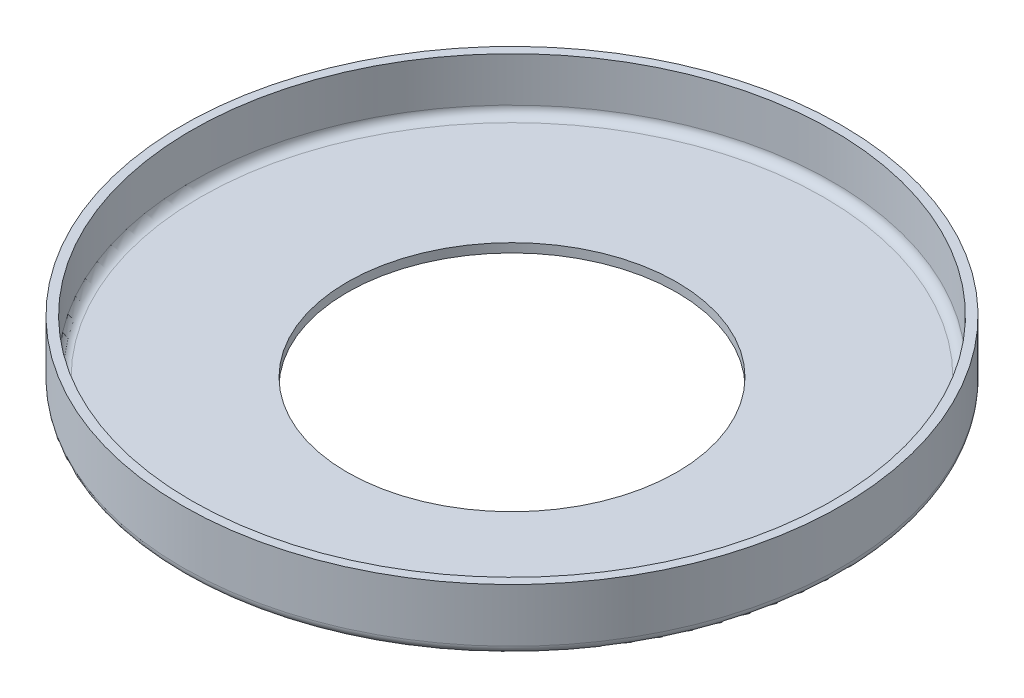
ISO-10303-21;
HEADER;
FILE_DESCRIPTION(('STEP AP214'),'2;1');
FILE_NAME('part.step','',(''),(''),'','','');
FILE_SCHEMA(('AUTOMOTIVE_DESIGN { 1 0 10303 214 1 1 1 1 }'));
ENDSEC;
DATA;
#1=APPLICATION_CONTEXT('core data for automotive mechanical design processes');
#2=APPLICATION_PROTOCOL_DEFINITION('international standard','automotive_design',2000,#1);
#3=PRODUCT_CONTEXT('',#1,'mechanical');
#4=PRODUCT('Part','Part','',(#3));
#5=PRODUCT_RELATED_PRODUCT_CATEGORY('part','',(#4));
#6=PRODUCT_DEFINITION_FORMATION('','',#4);
#7=PRODUCT_DEFINITION_CONTEXT('part definition',#1,'design');
#8=PRODUCT_DEFINITION('design','',#6,#7);
#9=PRODUCT_DEFINITION_SHAPE('','',#8);
#10=(LENGTH_UNIT() NAMED_UNIT(*) SI_UNIT(.MILLI.,.METRE.));
#11=(NAMED_UNIT(*) PLANE_ANGLE_UNIT() SI_UNIT($,.RADIAN.));
#12=(NAMED_UNIT(*) SI_UNIT($,.STERADIAN.) SOLID_ANGLE_UNIT());
#13=UNCERTAINTY_MEASURE_WITH_UNIT(LENGTH_MEASURE(1.E-05),#10,'distance_accuracy_value','');
#14=(GEOMETRIC_REPRESENTATION_CONTEXT(3) GLOBAL_UNCERTAINTY_ASSIGNED_CONTEXT((#13)) GLOBAL_UNIT_ASSIGNED_CONTEXT((#10,
#11,#12)) REPRESENTATION_CONTEXT('',''));
#15=CARTESIAN_POINT('',(0.,0.,0.));
#16=DIRECTION('',(0.,0.,1.));
#17=DIRECTION('',(1.,0.,0.));
#18=AXIS2_PLACEMENT_3D('',#15,#16,#17);
#19=CARTESIAN_POINT('',(0.,7.,0.));
#20=DIRECTION('',(0.,-1.,0.));
#21=DIRECTION('',(0.,0.,-1.));
#22=AXIS2_PLACEMENT_3D('',#19,#20,#21);
#23=CYLINDRICAL_SURFACE('',#22,37.);
#24=CARTESIAN_POINT('',(0.,1.,0.));
#25=DIRECTION('',(0.,1.,0.));
#26=DIRECTION('',(0.,0.,1.));
#27=AXIS2_PLACEMENT_3D('',#24,#25,#26);
#28=CIRCLE('',#27,37.);
#29=CARTESIAN_POINT('',(0.,1.,37.));
#30=VERTEX_POINT('',#29);
#31=EDGE_CURVE('E45',#30,#30,#28,.T.);
#32=ORIENTED_EDGE('',*,*,#31,.T.);
#33=EDGE_LOOP('',(#32));
#34=FACE_BOUND('',#33,.T.);
#35=CARTESIAN_POINT('',(0.,7.,0.));
#36=DIRECTION('',(0.,1.,0.));
#37=DIRECTION('',(0.,0.,1.));
#38=AXIS2_PLACEMENT_3D('',#35,#36,#37);
#39=CIRCLE('',#38,37.);
#40=CARTESIAN_POINT('',(0.,7.,37.));
#41=VERTEX_POINT('',#40);
#42=EDGE_CURVE('E50',#41,#41,#39,.T.);
#43=ORIENTED_EDGE('',*,*,#42,.F.);
#44=EDGE_LOOP('',(#43));
#45=FACE_BOUND('',#44,.T.);
#46=ADVANCED_FACE('F30',(#34,#45),#23,.T.);
#47=CARTESIAN_POINT('',(0.,7.,0.));
#48=DIRECTION('',(0.,1.,0.));
#49=DIRECTION('',(0.,0.,1.));
#50=AXIS2_PLACEMENT_3D('',#47,#48,#49);
#51=PLANE('',#50);
#52=CARTESIAN_POINT('',(0.,7.,0.));
#53=DIRECTION('',(0.,1.,0.));
#54=DIRECTION('',(0.,0.,1.));
#55=AXIS2_PLACEMENT_3D('',#52,#53,#54);
#56=CIRCLE('',#55,36.);
#57=CARTESIAN_POINT('',(0.,7.,36.));
#58=VERTEX_POINT('',#57);
#59=EDGE_CURVE('E54',#58,#58,#56,.T.);
#60=ORIENTED_EDGE('',*,*,#59,.F.);
#61=EDGE_LOOP('',(#60));
#62=FACE_BOUND('',#61,.T.);
#63=ORIENTED_EDGE('',*,*,#42,.T.);
#64=EDGE_LOOP('',(#63));
#65=FACE_BOUND('',#64,.T.);
#66=ADVANCED_FACE('F79',(#62,#65),#51,.T.);
#67=CARTESIAN_POINT('',(0.,0.,0.));
#68=DIRECTION('',(0.,1.,0.));
#69=DIRECTION('',(0.,0.,1.));
#70=AXIS2_PLACEMENT_3D('',#67,#68,#69);
#71=PLANE('',#70);
#72=CARTESIAN_POINT('',(0.,0.,0.));
#73=DIRECTION('',(0.,1.,0.));
#74=DIRECTION('',(0.,0.,1.));
#75=AXIS2_PLACEMENT_3D('',#72,#73,#74);
#76=CIRCLE('',#75,36.);
#77=CARTESIAN_POINT('',(0.,0.,36.));
#78=VERTEX_POINT('',#77);
#79=EDGE_CURVE('E41',#78,#78,#76,.F.);
#80=ORIENTED_EDGE('',*,*,#79,.T.);
#81=EDGE_LOOP('',(#80));
#82=FACE_BOUND('',#81,.T.);
#83=CARTESIAN_POINT('',(0.,0.,0.));
#84=DIRECTION('',(0.,1.,0.));
#85=DIRECTION('',(0.,0.,1.));
#86=AXIS2_PLACEMENT_3D('',#83,#84,#85);
#87=CIRCLE('',#86,18.5);
#88=CARTESIAN_POINT('',(0.,0.,18.5));
#89=VERTEX_POINT('',#88);
#90=EDGE_CURVE('E51',#89,#89,#87,.T.);
#91=ORIENTED_EDGE('',*,*,#90,.T.);
#92=EDGE_LOOP('',(#91));
#93=FACE_BOUND('',#92,.T.);
#94=ADVANCED_FACE('F76',(#82,#93),#71,.F.);
#95=CARTESIAN_POINT('',(0.,1.,0.));
#96=DIRECTION('',(0.,1.,0.));
#97=DIRECTION('',(0.,0.,1.));
#98=AXIS2_PLACEMENT_3D('',#95,#96,#97);
#99=CYLINDRICAL_SURFACE('',#98,36.);
#100=CARTESIAN_POINT('',(0.,2.,0.));
#101=DIRECTION('',(0.,1.,0.));
#102=DIRECTION('',(0.,0.,1.));
#103=AXIS2_PLACEMENT_3D('',#100,#101,#102);
#104=CIRCLE('',#103,36.);
#105=CARTESIAN_POINT('',(0.,2.,36.));
#106=VERTEX_POINT('',#105);
#107=EDGE_CURVE('E10',#106,#106,#104,.F.);
#108=ORIENTED_EDGE('',*,*,#107,.T.);
#109=EDGE_LOOP('',(#108));
#110=FACE_BOUND('',#109,.T.);
#111=ORIENTED_EDGE('',*,*,#59,.T.);
#112=EDGE_LOOP('',(#111));
#113=FACE_BOUND('',#112,.T.);
#114=ADVANCED_FACE('F68',(#110,#113),#99,.F.);
#115=CARTESIAN_POINT('',(0.,1.,0.));
#116=DIRECTION('',(0.,1.,0.));
#117=DIRECTION('',(0.,0.,1.));
#118=AXIS2_PLACEMENT_3D('',#115,#116,#117);
#119=PLANE('',#118);
#120=CARTESIAN_POINT('',(0.,1.,0.));
#121=DIRECTION('',(0.,1.,0.));
#122=DIRECTION('',(0.,0.,1.));
#123=AXIS2_PLACEMENT_3D('',#120,#121,#122);
#124=CIRCLE('',#123,35.);
#125=CARTESIAN_POINT('',(0.,1.,35.));
#126=VERTEX_POINT('',#125);
#127=EDGE_CURVE('E37',#126,#126,#124,.T.);
#128=ORIENTED_EDGE('',*,*,#127,.T.);
#129=EDGE_LOOP('',(#128));
#130=FACE_BOUND('',#129,.T.);
#131=CARTESIAN_POINT('',(0.,1.,0.));
#132=DIRECTION('',(0.,1.,0.));
#133=DIRECTION('',(0.,0.,1.));
#134=AXIS2_PLACEMENT_3D('',#131,#132,#133);
#135=CIRCLE('',#134,18.5);
#136=CARTESIAN_POINT('',(0.,1.,18.5));
#137=VERTEX_POINT('',#136);
#138=EDGE_CURVE('E55',#137,#137,#135,.T.);
#139=ORIENTED_EDGE('',*,*,#138,.F.);
#140=EDGE_LOOP('',(#139));
#141=FACE_BOUND('',#140,.T.);
#142=ADVANCED_FACE('F66',(#130,#141),#119,.T.);
#143=CARTESIAN_POINT('',(0.,-5.,0.));
#144=DIRECTION('',(0.,1.,0.));
#145=DIRECTION('',(0.,0.,1.));
#146=AXIS2_PLACEMENT_3D('',#143,#144,#145);
#147=CYLINDRICAL_SURFACE('',#146,18.5);
#148=ORIENTED_EDGE('',*,*,#138,.T.);
#149=EDGE_LOOP('',(#148));
#150=FACE_BOUND('',#149,.T.);
#151=ORIENTED_EDGE('',*,*,#90,.F.);
#152=EDGE_LOOP('',(#151));
#153=FACE_BOUND('',#152,.T.);
#154=ADVANCED_FACE('F63',(#150,#153),#147,.F.);
#155=CARTESIAN_POINT('',(0.,1.,0.));
#156=DIRECTION('',(0.,1.,0.));
#157=DIRECTION('',(0.,0.,1.));
#158=AXIS2_PLACEMENT_3D('',#155,#156,#157);
#159=TOROIDAL_SURFACE('',#158,36.,1.);
#160=ORIENTED_EDGE('',*,*,#79,.F.);
#161=EDGE_LOOP('',(#160));
#162=FACE_BOUND('',#161,.T.);
#163=ORIENTED_EDGE('',*,*,#31,.F.);
#164=EDGE_LOOP('',(#163));
#165=FACE_BOUND('',#164,.T.);
#166=ADVANCED_FACE('F74',(#162,#165),#159,.T.);
#167=CARTESIAN_POINT('',(0.,2.,0.));
#168=DIRECTION('',(0.,1.,0.));
#169=DIRECTION('',(0.,0.,1.));
#170=AXIS2_PLACEMENT_3D('',#167,#168,#169);
#171=TOROIDAL_SURFACE('',#170,35.,1.);
#172=ORIENTED_EDGE('',*,*,#107,.F.);
#173=EDGE_LOOP('',(#172));
#174=FACE_BOUND('',#173,.T.);
#175=ORIENTED_EDGE('',*,*,#127,.F.);
#176=EDGE_LOOP('',(#175));
#177=FACE_BOUND('',#176,.T.);
#178=ADVANCED_FACE('F32',(#174,#177),#171,.F.);
#179=CLOSED_SHELL('',(#46,#66,#94,#114,#142,#154,#166,#178));
#180=MANIFOLD_SOLID_BREP('B2',#179);
#181=ADVANCED_BREP_SHAPE_REPRESENTATION('',(#18,#180),#14);
#182=SHAPE_DEFINITION_REPRESENTATION(#9,#181);
ENDSEC;
END-ISO-10303-21;
